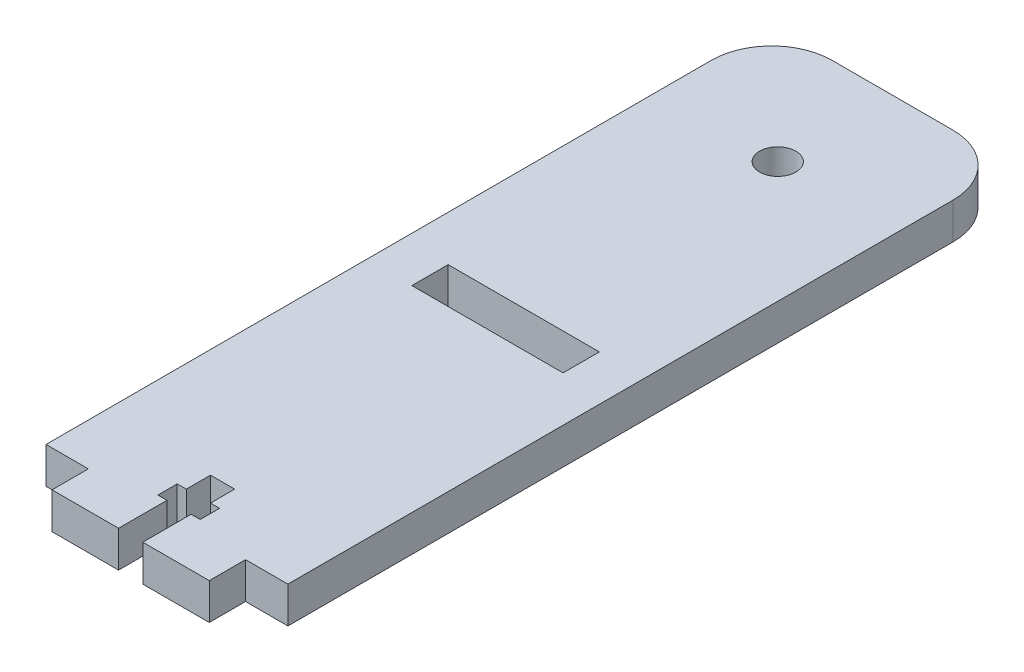
ISO-10303-21;
HEADER;
FILE_DESCRIPTION(('STEP AP214'),'2;1');
FILE_NAME('part.step','',(''),(''),'','','');
FILE_SCHEMA(('AUTOMOTIVE_DESIGN { 1 0 10303 214 1 1 1 1 }'));
ENDSEC;
DATA;
#1=APPLICATION_CONTEXT('core data for automotive mechanical design processes');
#2=APPLICATION_PROTOCOL_DEFINITION('international standard','automotive_design',2000,#1);
#3=PRODUCT_CONTEXT('',#1,'mechanical');
#4=PRODUCT('Part','Part','',(#3));
#5=PRODUCT_RELATED_PRODUCT_CATEGORY('part','',(#4));
#6=PRODUCT_DEFINITION_FORMATION('','',#4);
#7=PRODUCT_DEFINITION_CONTEXT('part definition',#1,'design');
#8=PRODUCT_DEFINITION('design','',#6,#7);
#9=PRODUCT_DEFINITION_SHAPE('','',#8);
#10=(LENGTH_UNIT() NAMED_UNIT(*) SI_UNIT(.MILLI.,.METRE.));
#11=(NAMED_UNIT(*) PLANE_ANGLE_UNIT() SI_UNIT($,.RADIAN.));
#12=(NAMED_UNIT(*) SI_UNIT($,.STERADIAN.) SOLID_ANGLE_UNIT());
#13=UNCERTAINTY_MEASURE_WITH_UNIT(LENGTH_MEASURE(1.E-05),#10,'distance_accuracy_value','');
#14=(GEOMETRIC_REPRESENTATION_CONTEXT(3) GLOBAL_UNCERTAINTY_ASSIGNED_CONTEXT((#13)) GLOBAL_UNIT_ASSIGNED_CONTEXT((#10,
#11,#12)) REPRESENTATION_CONTEXT('',''));
#15=CARTESIAN_POINT('',(0.,0.,0.));
#16=DIRECTION('',(0.,0.,1.));
#17=DIRECTION('',(1.,0.,0.));
#18=AXIS2_PLACEMENT_3D('',#15,#16,#17);
#19=CARTESIAN_POINT('',(9.99999999999999,6.,-52.7617663064734));
#20=DIRECTION('',(0.,-1.,0.));
#21=DIRECTION('',(0.,0.,-1.));
#22=AXIS2_PLACEMENT_3D('',#19,#20,#21);
#23=PLANE('',#22);
#24=CARTESIAN_POINT('',(0.,6.,-43.7617663064734));
#25=DIRECTION('',(0.,1.,0.));
#26=DIRECTION('',(0.,0.,1.));
#27=AXIS2_PLACEMENT_3D('',#24,#25,#26);
#28=CIRCLE('',#27,3.);
#29=CARTESIAN_POINT('',(0.,6.,-40.7617663064734));
#30=VERTEX_POINT('',#29);
#31=EDGE_CURVE('E246',#30,#30,#28,.T.);
#32=ORIENTED_EDGE('',*,*,#31,.F.);
#33=EDGE_LOOP('',(#32));
#34=FACE_BOUND('',#33,.T.);
#35=DIRECTION('',(1.,0.,0.));
#36=VECTOR('',#35,1.);
#37=CARTESIAN_POINT('',(13.,6.,57.2382336935266));
#38=LINE('',#37,#36);
#39=CARTESIAN_POINT('',(13.,6.,57.2382336935266));
#40=VERTEX_POINT('',#39);
#41=CARTESIAN_POINT('',(20.,6.,57.2382336935266));
#42=VERTEX_POINT('',#41);
#43=EDGE_CURVE('E252',#40,#42,#38,.T.);
#44=ORIENTED_EDGE('',*,*,#43,.T.);
#45=DIRECTION('',(0.,0.,-1.));
#46=VECTOR('',#45,1.);
#47=CARTESIAN_POINT('',(20.,6.,-52.7617663064734));
#48=LINE('',#47,#46);
#49=CARTESIAN_POINT('',(20.,6.,-52.7617663064734));
#50=VERTEX_POINT('',#49);
#51=EDGE_CURVE('E255',#42,#50,#48,.T.);
#52=ORIENTED_EDGE('',*,*,#51,.T.);
#53=CARTESIAN_POINT('',(9.99999999999999,6.,-52.7617663064734));
#54=DIRECTION('',(0.,1.,0.));
#55=DIRECTION('',(0.,0.,-1.));
#56=AXIS2_PLACEMENT_3D('',#53,#54,#55);
#57=CIRCLE('',#56,10.);
#58=CARTESIAN_POINT('',(9.99999999999999,6.,-62.7617663064734));
#59=VERTEX_POINT('',#58);
#60=EDGE_CURVE('E258',#50,#59,#57,.T.);
#61=ORIENTED_EDGE('',*,*,#60,.T.);
#62=DIRECTION('',(-1.,0.,0.));
#63=VECTOR('',#62,1.);
#64=CARTESIAN_POINT('',(-10.,6.,-62.7617663064734));
#65=LINE('',#64,#63);
#66=CARTESIAN_POINT('',(-10.,6.,-62.7617663064734));
#67=VERTEX_POINT('',#66);
#68=EDGE_CURVE('E260',#59,#67,#65,.T.);
#69=ORIENTED_EDGE('',*,*,#68,.T.);
#70=CARTESIAN_POINT('',(-10.,6.,-52.7617663064734));
#71=DIRECTION('',(0.,1.,0.));
#72=DIRECTION('',(0.,0.,1.));
#73=AXIS2_PLACEMENT_3D('',#70,#71,#72);
#74=CIRCLE('',#73,10.);
#75=CARTESIAN_POINT('',(-20.,6.,-52.7617663064734));
#76=VERTEX_POINT('',#75);
#77=EDGE_CURVE('E262',#67,#76,#74,.T.);
#78=ORIENTED_EDGE('',*,*,#77,.T.);
#79=DIRECTION('',(0.,0.,1.));
#80=VECTOR('',#79,1.);
#81=CARTESIAN_POINT('',(-20.,6.,-52.7617663064734));
#82=LINE('',#81,#80);
#83=CARTESIAN_POINT('',(-20.,6.,57.2382336935266));
#84=VERTEX_POINT('',#83);
#85=EDGE_CURVE('E264',#76,#84,#82,.T.);
#86=ORIENTED_EDGE('',*,*,#85,.T.);
#87=DIRECTION('',(1.,0.,0.));
#88=VECTOR('',#87,1.);
#89=CARTESIAN_POINT('',(-20.,6.,57.2382336935266));
#90=LINE('',#89,#88);
#91=CARTESIAN_POINT('',(-13.,6.,57.2382336935266));
#92=VERTEX_POINT('',#91);
#93=EDGE_CURVE('E266',#84,#92,#90,.T.);
#94=ORIENTED_EDGE('',*,*,#93,.T.);
#95=DIRECTION('',(0.,0.,1.));
#96=VECTOR('',#95,1.);
#97=CARTESIAN_POINT('',(-13.,6.,57.2382336935266));
#98=LINE('',#97,#96);
#99=CARTESIAN_POINT('',(-13.,6.,63.2382336935266));
#100=VERTEX_POINT('',#99);
#101=EDGE_CURVE('E268',#92,#100,#98,.T.);
#102=ORIENTED_EDGE('',*,*,#101,.T.);
#103=DIRECTION('',(1.,0.,0.));
#104=VECTOR('',#103,1.);
#105=CARTESIAN_POINT('',(-13.,6.,63.2382336935266));
#106=LINE('',#105,#104);
#107=CARTESIAN_POINT('',(-1.99999999999998,6.,63.2382336935266));
#108=VERTEX_POINT('',#107);
#109=EDGE_CURVE('E270',#100,#108,#106,.T.);
#110=ORIENTED_EDGE('',*,*,#109,.T.);
#111=DIRECTION('',(0.,0.,-1.));
#112=VECTOR('',#111,1.);
#113=CARTESIAN_POINT('',(-1.99999999999998,6.,63.2382336935266));
#114=LINE('',#113,#112);
#115=CARTESIAN_POINT('',(-1.99999999999998,6.,55.2382336935266));
#116=VERTEX_POINT('',#115);
#117=EDGE_CURVE('E272',#108,#116,#114,.T.);
#118=ORIENTED_EDGE('',*,*,#117,.T.);
#119=DIRECTION('',(-1.,0.,0.));
#120=VECTOR('',#119,1.);
#121=CARTESIAN_POINT('',(-1.99999999999998,6.,55.2382336935266));
#122=LINE('',#121,#120);
#123=CARTESIAN_POINT('',(-3.49999999999998,6.,55.2382336935266));
#124=VERTEX_POINT('',#123);
#125=EDGE_CURVE('E274',#116,#124,#122,.T.);
#126=ORIENTED_EDGE('',*,*,#125,.T.);
#127=DIRECTION('',(0.,0.,-1.));
#128=VECTOR('',#127,1.);
#129=CARTESIAN_POINT('',(-3.49999999999998,6.,55.2382336935266));
#130=LINE('',#129,#128);
#131=CARTESIAN_POINT('',(-3.49999999999998,6.,52.0382336935266));
#132=VERTEX_POINT('',#131);
#133=EDGE_CURVE('E276',#124,#132,#130,.T.);
#134=ORIENTED_EDGE('',*,*,#133,.T.);
#135=DIRECTION('',(1.,0.,0.));
#136=VECTOR('',#135,1.);
#137=CARTESIAN_POINT('',(-3.49999999999998,6.,52.0382336935266));
#138=LINE('',#137,#136);
#139=CARTESIAN_POINT('',(-1.99999999999998,6.,52.0382336935266));
#140=VERTEX_POINT('',#139);
#141=EDGE_CURVE('E278',#132,#140,#138,.T.);
#142=ORIENTED_EDGE('',*,*,#141,.T.);
#143=DIRECTION('',(0.,0.,-1.));
#144=VECTOR('',#143,1.);
#145=CARTESIAN_POINT('',(-1.99999999999998,6.,52.0382336935266));
#146=LINE('',#145,#144);
#147=CARTESIAN_POINT('',(-1.99999999999998,6.,48.0382336935266));
#148=VERTEX_POINT('',#147);
#149=EDGE_CURVE('E280',#140,#148,#146,.T.);
#150=ORIENTED_EDGE('',*,*,#149,.T.);
#151=DIRECTION('',(1.,0.,0.));
#152=VECTOR('',#151,1.);
#153=CARTESIAN_POINT('',(-1.99999999999998,6.,48.0382336935266));
#154=LINE('',#153,#152);
#155=CARTESIAN_POINT('',(2.00000000000002,6.,48.0382336935266));
#156=VERTEX_POINT('',#155);
#157=EDGE_CURVE('E282',#148,#156,#154,.T.);
#158=ORIENTED_EDGE('',*,*,#157,.T.);
#159=DIRECTION('',(0.,0.,1.));
#160=VECTOR('',#159,1.);
#161=CARTESIAN_POINT('',(2.00000000000002,6.,48.0382336935266));
#162=LINE('',#161,#160);
#163=CARTESIAN_POINT('',(2.00000000000002,6.,52.0382336935266));
#164=VERTEX_POINT('',#163);
#165=EDGE_CURVE('E284',#156,#164,#162,.T.);
#166=ORIENTED_EDGE('',*,*,#165,.T.);
#167=DIRECTION('',(1.,0.,0.));
#168=VECTOR('',#167,1.);
#169=CARTESIAN_POINT('',(2.00000000000002,6.,52.0382336935266));
#170=LINE('',#169,#168);
#171=CARTESIAN_POINT('',(3.50000000000002,6.,52.0382336935266));
#172=VERTEX_POINT('',#171);
#173=EDGE_CURVE('E286',#164,#172,#170,.T.);
#174=ORIENTED_EDGE('',*,*,#173,.T.);
#175=DIRECTION('',(0.,0.,1.));
#176=VECTOR('',#175,1.);
#177=CARTESIAN_POINT('',(3.50000000000002,6.,52.0382336935266));
#178=LINE('',#177,#176);
#179=CARTESIAN_POINT('',(3.50000000000002,6.,55.2382336935266));
#180=VERTEX_POINT('',#179);
#181=EDGE_CURVE('E288',#172,#180,#178,.T.);
#182=ORIENTED_EDGE('',*,*,#181,.T.);
#183=DIRECTION('',(-1.,0.,0.));
#184=VECTOR('',#183,1.);
#185=CARTESIAN_POINT('',(3.50000000000002,6.,55.2382336935266));
#186=LINE('',#185,#184);
#187=CARTESIAN_POINT('',(2.00000000000002,6.,55.2382336935266));
#188=VERTEX_POINT('',#187);
#189=EDGE_CURVE('E290',#180,#188,#186,.T.);
#190=ORIENTED_EDGE('',*,*,#189,.T.);
#191=DIRECTION('',(0.,0.,1.));
#192=VECTOR('',#191,1.);
#193=CARTESIAN_POINT('',(2.00000000000002,6.,55.2382336935266));
#194=LINE('',#193,#192);
#195=CARTESIAN_POINT('',(2.00000000000002,6.,63.2382336935266));
#196=VERTEX_POINT('',#195);
#197=EDGE_CURVE('E292',#188,#196,#194,.T.);
#198=ORIENTED_EDGE('',*,*,#197,.T.);
#199=DIRECTION('',(1.,0.,0.));
#200=VECTOR('',#199,1.);
#201=CARTESIAN_POINT('',(2.00000000000002,6.,63.2382336935266));
#202=LINE('',#201,#200);
#203=CARTESIAN_POINT('',(13.,6.,63.2382336935266));
#204=VERTEX_POINT('',#203);
#205=EDGE_CURVE('E294',#196,#204,#202,.T.);
#206=ORIENTED_EDGE('',*,*,#205,.T.);
#207=DIRECTION('',(0.,0.,-1.));
#208=VECTOR('',#207,1.);
#209=CARTESIAN_POINT('',(13.,6.,63.2382336935266));
#210=LINE('',#209,#208);
#211=EDGE_CURVE('E296',#204,#40,#210,.T.);
#212=ORIENTED_EDGE('',*,*,#211,.T.);
#213=EDGE_LOOP('',(#44,#52,#61,#69,#78,#86,#94,#102,#110,#118,#126,#134,#142,#150,#158,#166,
#174,#182,#190,#198,#206,#212));
#214=FACE_BOUND('',#213,.T.);
#215=DIRECTION('',(0.,0.,-1.));
#216=VECTOR('',#215,1.);
#217=CARTESIAN_POINT('',(12.5,6.,-1.7617663064734));
#218=LINE('',#217,#216);
#219=CARTESIAN_POINT('',(12.5,6.,4.23823369352659));
#220=VERTEX_POINT('',#219);
#221=CARTESIAN_POINT('',(12.5,6.,-1.7617663064734));
#222=VERTEX_POINT('',#221);
#223=EDGE_CURVE('E210',#220,#222,#218,.T.);
#224=ORIENTED_EDGE('',*,*,#223,.F.);
#225=DIRECTION('',(1.,0.,0.));
#226=VECTOR('',#225,1.);
#227=CARTESIAN_POINT('',(-12.5,6.,4.23823369352659));
#228=LINE('',#227,#226);
#229=CARTESIAN_POINT('',(-12.5,6.,4.23823369352659));
#230=VERTEX_POINT('',#229);
#231=EDGE_CURVE('E232',#230,#220,#228,.T.);
#232=ORIENTED_EDGE('',*,*,#231,.F.);
#233=DIRECTION('',(0.,0.,1.));
#234=VECTOR('',#233,1.);
#235=CARTESIAN_POINT('',(-12.5,6.,-1.7617663064734));
#236=LINE('',#235,#234);
#237=CARTESIAN_POINT('',(-12.5,6.,-1.7617663064734));
#238=VERTEX_POINT('',#237);
#239=EDGE_CURVE('E230',#238,#230,#236,.T.);
#240=ORIENTED_EDGE('',*,*,#239,.F.);
#241=DIRECTION('',(-1.,0.,0.));
#242=VECTOR('',#241,1.);
#243=CARTESIAN_POINT('',(-12.5,6.,-1.7617663064734));
#244=LINE('',#243,#242);
#245=EDGE_CURVE('E218',#222,#238,#244,.T.);
#246=ORIENTED_EDGE('',*,*,#245,.F.);
#247=EDGE_LOOP('',(#224,#232,#240,#246));
#248=FACE_BOUND('',#247,.T.);
#249=ADVANCED_FACE('F37',(#34,#214,#248),#23,.F.);
#250=CARTESIAN_POINT('',(9.99999999999999,0.,-52.7617663064734));
#251=DIRECTION('',(0.,-1.,0.));
#252=DIRECTION('',(0.,0.,-1.));
#253=AXIS2_PLACEMENT_3D('',#250,#251,#252);
#254=PLANE('',#253);
#255=DIRECTION('',(1.,0.,0.));
#256=VECTOR('',#255,1.);
#257=CARTESIAN_POINT('',(13.,0.,57.2382336935266));
#258=LINE('',#257,#256);
#259=CARTESIAN_POINT('',(13.,0.,57.2382336935266));
#260=VERTEX_POINT('',#259);
#261=CARTESIAN_POINT('',(20.,0.,57.2382336935266));
#262=VERTEX_POINT('',#261);
#263=EDGE_CURVE('E249',#260,#262,#258,.T.);
#264=ORIENTED_EDGE('',*,*,#263,.F.);
#265=DIRECTION('',(0.,0.,-1.));
#266=VECTOR('',#265,1.);
#267=CARTESIAN_POINT('',(13.,0.,63.2382336935266));
#268=LINE('',#267,#266);
#269=CARTESIAN_POINT('',(13.,0.,63.2382336935266));
#270=VERTEX_POINT('',#269);
#271=EDGE_CURVE('E256',#270,#260,#268,.T.);
#272=ORIENTED_EDGE('',*,*,#271,.F.);
#273=DIRECTION('',(1.,0.,0.));
#274=VECTOR('',#273,1.);
#275=CARTESIAN_POINT('',(2.00000000000002,0.,63.2382336935266));
#276=LINE('',#275,#274);
#277=CARTESIAN_POINT('',(2.00000000000002,0.,63.2382336935266));
#278=VERTEX_POINT('',#277);
#279=EDGE_CURVE('E339',#278,#270,#276,.T.);
#280=ORIENTED_EDGE('',*,*,#279,.F.);
#281=DIRECTION('',(0.,0.,1.));
#282=VECTOR('',#281,1.);
#283=CARTESIAN_POINT('',(2.00000000000002,0.,55.2382336935266));
#284=LINE('',#283,#282);
#285=CARTESIAN_POINT('',(2.00000000000002,0.,55.2382336935266));
#286=VERTEX_POINT('',#285);
#287=EDGE_CURVE('E337',#286,#278,#284,.T.);
#288=ORIENTED_EDGE('',*,*,#287,.F.);
#289=DIRECTION('',(-1.,0.,0.));
#290=VECTOR('',#289,1.);
#291=CARTESIAN_POINT('',(3.50000000000002,0.,55.2382336935266));
#292=LINE('',#291,#290);
#293=CARTESIAN_POINT('',(3.50000000000002,0.,55.2382336935266));
#294=VERTEX_POINT('',#293);
#295=EDGE_CURVE('E335',#294,#286,#292,.T.);
#296=ORIENTED_EDGE('',*,*,#295,.F.);
#297=DIRECTION('',(0.,0.,1.));
#298=VECTOR('',#297,1.);
#299=CARTESIAN_POINT('',(3.50000000000002,0.,52.0382336935266));
#300=LINE('',#299,#298);
#301=CARTESIAN_POINT('',(3.50000000000002,0.,52.0382336935266));
#302=VERTEX_POINT('',#301);
#303=EDGE_CURVE('E333',#302,#294,#300,.T.);
#304=ORIENTED_EDGE('',*,*,#303,.F.);
#305=DIRECTION('',(1.,0.,0.));
#306=VECTOR('',#305,1.);
#307=CARTESIAN_POINT('',(2.00000000000002,0.,52.0382336935266));
#308=LINE('',#307,#306);
#309=CARTESIAN_POINT('',(2.00000000000002,0.,52.0382336935266));
#310=VERTEX_POINT('',#309);
#311=EDGE_CURVE('E331',#310,#302,#308,.T.);
#312=ORIENTED_EDGE('',*,*,#311,.F.);
#313=DIRECTION('',(0.,0.,1.));
#314=VECTOR('',#313,1.);
#315=CARTESIAN_POINT('',(2.00000000000002,0.,48.0382336935266));
#316=LINE('',#315,#314);
#317=CARTESIAN_POINT('',(2.00000000000002,0.,48.0382336935266));
#318=VERTEX_POINT('',#317);
#319=EDGE_CURVE('E329',#318,#310,#316,.T.);
#320=ORIENTED_EDGE('',*,*,#319,.F.);
#321=DIRECTION('',(1.,0.,0.));
#322=VECTOR('',#321,1.);
#323=CARTESIAN_POINT('',(-1.99999999999998,0.,48.0382336935266));
#324=LINE('',#323,#322);
#325=CARTESIAN_POINT('',(-1.99999999999998,0.,48.0382336935266));
#326=VERTEX_POINT('',#325);
#327=EDGE_CURVE('E327',#326,#318,#324,.T.);
#328=ORIENTED_EDGE('',*,*,#327,.F.);
#329=DIRECTION('',(0.,0.,-1.));
#330=VECTOR('',#329,1.);
#331=CARTESIAN_POINT('',(-1.99999999999998,0.,52.0382336935266));
#332=LINE('',#331,#330);
#333=CARTESIAN_POINT('',(-1.99999999999998,0.,52.0382336935266));
#334=VERTEX_POINT('',#333);
#335=EDGE_CURVE('E325',#334,#326,#332,.T.);
#336=ORIENTED_EDGE('',*,*,#335,.F.);
#337=DIRECTION('',(1.,0.,0.));
#338=VECTOR('',#337,1.);
#339=CARTESIAN_POINT('',(-3.49999999999998,0.,52.0382336935266));
#340=LINE('',#339,#338);
#341=CARTESIAN_POINT('',(-3.49999999999998,0.,52.0382336935266));
#342=VERTEX_POINT('',#341);
#343=EDGE_CURVE('E323',#342,#334,#340,.T.);
#344=ORIENTED_EDGE('',*,*,#343,.F.);
#345=DIRECTION('',(0.,0.,-1.));
#346=VECTOR('',#345,1.);
#347=CARTESIAN_POINT('',(-3.49999999999998,0.,55.2382336935266));
#348=LINE('',#347,#346);
#349=CARTESIAN_POINT('',(-3.49999999999998,0.,55.2382336935266));
#350=VERTEX_POINT('',#349);
#351=EDGE_CURVE('E321',#350,#342,#348,.T.);
#352=ORIENTED_EDGE('',*,*,#351,.F.);
#353=DIRECTION('',(-1.,0.,0.));
#354=VECTOR('',#353,1.);
#355=CARTESIAN_POINT('',(-1.99999999999998,0.,55.2382336935266));
#356=LINE('',#355,#354);
#357=CARTESIAN_POINT('',(-1.99999999999998,0.,55.2382336935266));
#358=VERTEX_POINT('',#357);
#359=EDGE_CURVE('E319',#358,#350,#356,.T.);
#360=ORIENTED_EDGE('',*,*,#359,.F.);
#361=DIRECTION('',(0.,0.,-1.));
#362=VECTOR('',#361,1.);
#363=CARTESIAN_POINT('',(-1.99999999999998,0.,63.2382336935266));
#364=LINE('',#363,#362);
#365=CARTESIAN_POINT('',(-1.99999999999998,0.,63.2382336935266));
#366=VERTEX_POINT('',#365);
#367=EDGE_CURVE('E317',#366,#358,#364,.T.);
#368=ORIENTED_EDGE('',*,*,#367,.F.);
#369=DIRECTION('',(1.,0.,0.));
#370=VECTOR('',#369,1.);
#371=CARTESIAN_POINT('',(-13.,0.,63.2382336935266));
#372=LINE('',#371,#370);
#373=CARTESIAN_POINT('',(-13.,0.,63.2382336935266));
#374=VERTEX_POINT('',#373);
#375=EDGE_CURVE('E315',#374,#366,#372,.T.);
#376=ORIENTED_EDGE('',*,*,#375,.F.);
#377=DIRECTION('',(0.,0.,1.));
#378=VECTOR('',#377,1.);
#379=CARTESIAN_POINT('',(-13.,0.,57.2382336935266));
#380=LINE('',#379,#378);
#381=CARTESIAN_POINT('',(-13.,0.,57.2382336935266));
#382=VERTEX_POINT('',#381);
#383=EDGE_CURVE('E313',#382,#374,#380,.T.);
#384=ORIENTED_EDGE('',*,*,#383,.F.);
#385=DIRECTION('',(1.,0.,0.));
#386=VECTOR('',#385,1.);
#387=CARTESIAN_POINT('',(-20.,0.,57.2382336935266));
#388=LINE('',#387,#386);
#389=CARTESIAN_POINT('',(-20.,0.,57.2382336935266));
#390=VERTEX_POINT('',#389);
#391=EDGE_CURVE('E311',#390,#382,#388,.T.);
#392=ORIENTED_EDGE('',*,*,#391,.F.);
#393=DIRECTION('',(0.,0.,1.));
#394=VECTOR('',#393,1.);
#395=CARTESIAN_POINT('',(-20.,0.,-52.7617663064734));
#396=LINE('',#395,#394);
#397=CARTESIAN_POINT('',(-20.,0.,-52.7617663064734));
#398=VERTEX_POINT('',#397);
#399=EDGE_CURVE('E309',#398,#390,#396,.T.);
#400=ORIENTED_EDGE('',*,*,#399,.F.);
#401=CARTESIAN_POINT('',(-10.,0.,-52.7617663064734));
#402=DIRECTION('',(0.,1.,0.));
#403=DIRECTION('',(0.,0.,1.));
#404=AXIS2_PLACEMENT_3D('',#401,#402,#403);
#405=CIRCLE('',#404,10.);
#406=CARTESIAN_POINT('',(-10.,0.,-62.7617663064734));
#407=VERTEX_POINT('',#406);
#408=EDGE_CURVE('E307',#407,#398,#405,.T.);
#409=ORIENTED_EDGE('',*,*,#408,.F.);
#410=DIRECTION('',(-1.,0.,0.));
#411=VECTOR('',#410,1.);
#412=CARTESIAN_POINT('',(-10.,0.,-62.7617663064734));
#413=LINE('',#412,#411);
#414=CARTESIAN_POINT('',(9.99999999999999,0.,-62.7617663064734));
#415=VERTEX_POINT('',#414);
#416=EDGE_CURVE('E305',#415,#407,#413,.T.);
#417=ORIENTED_EDGE('',*,*,#416,.F.);
#418=CARTESIAN_POINT('',(9.99999999999999,0.,-52.7617663064734));
#419=DIRECTION('',(0.,1.,0.));
#420=DIRECTION('',(0.,0.,-1.));
#421=AXIS2_PLACEMENT_3D('',#418,#419,#420);
#422=CIRCLE('',#421,10.);
#423=CARTESIAN_POINT('',(20.,0.,-52.7617663064734));
#424=VERTEX_POINT('',#423);
#425=EDGE_CURVE('E303',#424,#415,#422,.T.);
#426=ORIENTED_EDGE('',*,*,#425,.F.);
#427=DIRECTION('',(0.,0.,-1.));
#428=VECTOR('',#427,1.);
#429=CARTESIAN_POINT('',(20.,0.,-52.7617663064734));
#430=LINE('',#429,#428);
#431=EDGE_CURVE('E301',#262,#424,#430,.T.);
#432=ORIENTED_EDGE('',*,*,#431,.F.);
#433=EDGE_LOOP('',(#264,#272,#280,#288,#296,#304,#312,#320,#328,#336,#344,#352,#360,#368,#376,
#384,#392,#400,#409,#417,#426,#432));
#434=FACE_BOUND('',#433,.T.);
#435=CARTESIAN_POINT('',(0.,0.,-43.7617663064734));
#436=DIRECTION('',(0.,1.,0.));
#437=DIRECTION('',(0.,0.,1.));
#438=AXIS2_PLACEMENT_3D('',#435,#436,#437);
#439=CIRCLE('',#438,3.);
#440=CARTESIAN_POINT('',(0.,0.,-40.7617663064734));
#441=VERTEX_POINT('',#440);
#442=EDGE_CURVE('E226',#441,#441,#439,.T.);
#443=ORIENTED_EDGE('',*,*,#442,.T.);
#444=EDGE_LOOP('',(#443));
#445=FACE_BOUND('',#444,.T.);
#446=DIRECTION('',(1.,0.,0.));
#447=VECTOR('',#446,1.);
#448=CARTESIAN_POINT('',(-12.5,0.,4.23823369352659));
#449=LINE('',#448,#447);
#450=CARTESIAN_POINT('',(-12.5,0.,4.23823369352659));
#451=VERTEX_POINT('',#450);
#452=CARTESIAN_POINT('',(12.5,0.,4.23823369352659));
#453=VERTEX_POINT('',#452);
#454=EDGE_CURVE('E219',#451,#453,#449,.T.);
#455=ORIENTED_EDGE('',*,*,#454,.T.);
#456=DIRECTION('',(0.,0.,-1.));
#457=VECTOR('',#456,1.);
#458=CARTESIAN_POINT('',(12.5,0.,-1.7617663064734));
#459=LINE('',#458,#457);
#460=CARTESIAN_POINT('',(12.5,0.,-1.7617663064734));
#461=VERTEX_POINT('',#460);
#462=EDGE_CURVE('E60',#453,#461,#459,.T.);
#463=ORIENTED_EDGE('',*,*,#462,.T.);
#464=DIRECTION('',(-1.,0.,0.));
#465=VECTOR('',#464,1.);
#466=CARTESIAN_POINT('',(-12.5,0.,-1.7617663064734));
#467=LINE('',#466,#465);
#468=CARTESIAN_POINT('',(-12.5,0.,-1.7617663064734));
#469=VERTEX_POINT('',#468);
#470=EDGE_CURVE('E225',#461,#469,#467,.T.);
#471=ORIENTED_EDGE('',*,*,#470,.T.);
#472=DIRECTION('',(0.,0.,1.));
#473=VECTOR('',#472,1.);
#474=CARTESIAN_POINT('',(-12.5,0.,-1.7617663064734));
#475=LINE('',#474,#473);
#476=EDGE_CURVE('E238',#469,#451,#475,.T.);
#477=ORIENTED_EDGE('',*,*,#476,.T.);
#478=EDGE_LOOP('',(#455,#463,#471,#477));
#479=FACE_BOUND('',#478,.T.);
#480=ADVANCED_FACE('F411',(#434,#445,#479),#254,.T.);
#481=CARTESIAN_POINT('',(13.,6.,57.2382336935266));
#482=DIRECTION('',(0.,0.,-1.));
#483=DIRECTION('',(-1.,0.,0.));
#484=AXIS2_PLACEMENT_3D('',#481,#482,#483);
#485=PLANE('',#484);
#486=ORIENTED_EDGE('',*,*,#263,.T.);
#487=DIRECTION('',(0.,-1.,0.));
#488=VECTOR('',#487,1.);
#489=CARTESIAN_POINT('',(20.,6.,57.2382336935266));
#490=LINE('',#489,#488);
#491=EDGE_CURVE('E11',#42,#262,#490,.T.);
#492=ORIENTED_EDGE('',*,*,#491,.F.);
#493=ORIENTED_EDGE('',*,*,#43,.F.);
#494=DIRECTION('',(0.,-1.,0.));
#495=VECTOR('',#494,1.);
#496=CARTESIAN_POINT('',(13.,6.,57.2382336935266));
#497=LINE('',#496,#495);
#498=EDGE_CURVE('E298',#40,#260,#497,.T.);
#499=ORIENTED_EDGE('',*,*,#498,.T.);
#500=EDGE_LOOP('',(#486,#492,#493,#499));
#501=FACE_BOUND('',#500,.T.);
#502=ADVANCED_FACE('F39',(#501),#485,.F.);
#503=CARTESIAN_POINT('',(20.,6.,-52.7617663064734));
#504=DIRECTION('',(-1.,0.,0.));
#505=DIRECTION('',(0.,0.,1.));
#506=AXIS2_PLACEMENT_3D('',#503,#504,#505);
#507=PLANE('',#506);
#508=ORIENTED_EDGE('',*,*,#431,.T.);
#509=DIRECTION('',(0.,-1.,0.));
#510=VECTOR('',#509,1.);
#511=CARTESIAN_POINT('',(20.,6.,-52.7617663064734));
#512=LINE('',#511,#510);
#513=EDGE_CURVE('E45',#50,#424,#512,.T.);
#514=ORIENTED_EDGE('',*,*,#513,.F.);
#515=ORIENTED_EDGE('',*,*,#51,.F.);
#516=ORIENTED_EDGE('',*,*,#491,.T.);
#517=EDGE_LOOP('',(#508,#514,#515,#516));
#518=FACE_BOUND('',#517,.T.);
#519=ADVANCED_FACE('F428',(#518),#507,.F.);
#520=CARTESIAN_POINT('',(9.99999999999999,6.,-52.7617663064734));
#521=DIRECTION('',(0.,-1.,0.));
#522=DIRECTION('',(0.,0.,-1.));
#523=AXIS2_PLACEMENT_3D('',#520,#521,#522);
#524=CYLINDRICAL_SURFACE('',#523,10.);
#525=ORIENTED_EDGE('',*,*,#425,.T.);
#526=DIRECTION('',(0.,-1.,0.));
#527=VECTOR('',#526,1.);
#528=CARTESIAN_POINT('',(9.99999999999999,6.,-62.7617663064734));
#529=LINE('',#528,#527);
#530=EDGE_CURVE('E398',#59,#415,#529,.T.);
#531=ORIENTED_EDGE('',*,*,#530,.F.);
#532=ORIENTED_EDGE('',*,*,#60,.F.);
#533=ORIENTED_EDGE('',*,*,#513,.T.);
#534=EDGE_LOOP('',(#525,#531,#532,#533));
#535=FACE_BOUND('',#534,.T.);
#536=ADVANCED_FACE('F405',(#535),#524,.T.);
#537=CARTESIAN_POINT('',(-10.,6.,-62.7617663064734));
#538=DIRECTION('',(0.,0.,1.));
#539=DIRECTION('',(1.,0.,0.));
#540=AXIS2_PLACEMENT_3D('',#537,#538,#539);
#541=PLANE('',#540);
#542=ORIENTED_EDGE('',*,*,#416,.T.);
#543=DIRECTION('',(0.,-1.,0.));
#544=VECTOR('',#543,1.);
#545=CARTESIAN_POINT('',(-10.,6.,-62.7617663064734));
#546=LINE('',#545,#544);
#547=EDGE_CURVE('E395',#67,#407,#546,.T.);
#548=ORIENTED_EDGE('',*,*,#547,.F.);
#549=ORIENTED_EDGE('',*,*,#68,.F.);
#550=ORIENTED_EDGE('',*,*,#530,.T.);
#551=EDGE_LOOP('',(#542,#548,#549,#550));
#552=FACE_BOUND('',#551,.T.);
#553=ADVANCED_FACE('F417',(#552),#541,.F.);
#554=CARTESIAN_POINT('',(-10.,6.,-52.7617663064734));
#555=DIRECTION('',(0.,-1.,0.));
#556=DIRECTION('',(0.,0.,-1.));
#557=AXIS2_PLACEMENT_3D('',#554,#555,#556);
#558=CYLINDRICAL_SURFACE('',#557,10.);
#559=ORIENTED_EDGE('',*,*,#408,.T.);
#560=DIRECTION('',(0.,-1.,0.));
#561=VECTOR('',#560,1.);
#562=CARTESIAN_POINT('',(-20.,6.,-52.7617663064734));
#563=LINE('',#562,#561);
#564=EDGE_CURVE('E392',#76,#398,#563,.T.);
#565=ORIENTED_EDGE('',*,*,#564,.F.);
#566=ORIENTED_EDGE('',*,*,#77,.F.);
#567=ORIENTED_EDGE('',*,*,#547,.T.);
#568=EDGE_LOOP('',(#559,#565,#566,#567));
#569=FACE_BOUND('',#568,.T.);
#570=ADVANCED_FACE('F421',(#569),#558,.T.);
#571=CARTESIAN_POINT('',(-20.,6.,-52.7617663064734));
#572=DIRECTION('',(1.,0.,0.));
#573=DIRECTION('',(0.,0.,-1.));
#574=AXIS2_PLACEMENT_3D('',#571,#572,#573);
#575=PLANE('',#574);
#576=ORIENTED_EDGE('',*,*,#399,.T.);
#577=DIRECTION('',(0.,-1.,0.));
#578=VECTOR('',#577,1.);
#579=CARTESIAN_POINT('',(-20.,6.,57.2382336935266));
#580=LINE('',#579,#578);
#581=EDGE_CURVE('E389',#84,#390,#580,.T.);
#582=ORIENTED_EDGE('',*,*,#581,.F.);
#583=ORIENTED_EDGE('',*,*,#85,.F.);
#584=ORIENTED_EDGE('',*,*,#564,.T.);
#585=EDGE_LOOP('',(#576,#582,#583,#584));
#586=FACE_BOUND('',#585,.T.);
#587=ADVANCED_FACE('F511',(#586),#575,.F.);
#588=CARTESIAN_POINT('',(-20.,6.,57.2382336935266));
#589=DIRECTION('',(0.,0.,-1.));
#590=DIRECTION('',(-1.,0.,0.));
#591=AXIS2_PLACEMENT_3D('',#588,#589,#590);
#592=PLANE('',#591);
#593=ORIENTED_EDGE('',*,*,#391,.T.);
#594=DIRECTION('',(0.,-1.,0.));
#595=VECTOR('',#594,1.);
#596=CARTESIAN_POINT('',(-13.,6.,57.2382336935266));
#597=LINE('',#596,#595);
#598=EDGE_CURVE('E386',#92,#382,#597,.T.);
#599=ORIENTED_EDGE('',*,*,#598,.F.);
#600=ORIENTED_EDGE('',*,*,#93,.F.);
#601=ORIENTED_EDGE('',*,*,#581,.T.);
#602=EDGE_LOOP('',(#593,#599,#600,#601));
#603=FACE_BOUND('',#602,.T.);
#604=ADVANCED_FACE('F508',(#603),#592,.F.);
#605=CARTESIAN_POINT('',(-13.,6.,57.2382336935266));
#606=DIRECTION('',(1.,0.,0.));
#607=DIRECTION('',(0.,0.,-1.));
#608=AXIS2_PLACEMENT_3D('',#605,#606,#607);
#609=PLANE('',#608);
#610=ORIENTED_EDGE('',*,*,#383,.T.);
#611=DIRECTION('',(0.,-1.,0.));
#612=VECTOR('',#611,1.);
#613=CARTESIAN_POINT('',(-13.,6.,63.2382336935266));
#614=LINE('',#613,#612);
#615=EDGE_CURVE('E383',#100,#374,#614,.T.);
#616=ORIENTED_EDGE('',*,*,#615,.F.);
#617=ORIENTED_EDGE('',*,*,#101,.F.);
#618=ORIENTED_EDGE('',*,*,#598,.T.);
#619=EDGE_LOOP('',(#610,#616,#617,#618));
#620=FACE_BOUND('',#619,.T.);
#621=ADVANCED_FACE('F504',(#620),#609,.F.);
#622=CARTESIAN_POINT('',(-13.,6.,63.2382336935266));
#623=DIRECTION('',(0.,0.,-1.));
#624=DIRECTION('',(-1.,0.,0.));
#625=AXIS2_PLACEMENT_3D('',#622,#623,#624);
#626=PLANE('',#625);
#627=ORIENTED_EDGE('',*,*,#375,.T.);
#628=DIRECTION('',(0.,-1.,0.));
#629=VECTOR('',#628,1.);
#630=CARTESIAN_POINT('',(-1.99999999999998,6.,63.2382336935266));
#631=LINE('',#630,#629);
#632=EDGE_CURVE('E380',#108,#366,#631,.T.);
#633=ORIENTED_EDGE('',*,*,#632,.F.);
#634=ORIENTED_EDGE('',*,*,#109,.F.);
#635=ORIENTED_EDGE('',*,*,#615,.T.);
#636=EDGE_LOOP('',(#627,#633,#634,#635));
#637=FACE_BOUND('',#636,.T.);
#638=ADVANCED_FACE('F500',(#637),#626,.F.);
#639=CARTESIAN_POINT('',(-1.99999999999998,6.,63.2382336935266));
#640=DIRECTION('',(-1.,0.,0.));
#641=DIRECTION('',(0.,0.,1.));
#642=AXIS2_PLACEMENT_3D('',#639,#640,#641);
#643=PLANE('',#642);
#644=ORIENTED_EDGE('',*,*,#367,.T.);
#645=DIRECTION('',(0.,-1.,0.));
#646=VECTOR('',#645,1.);
#647=CARTESIAN_POINT('',(-1.99999999999998,6.,55.2382336935266));
#648=LINE('',#647,#646);
#649=EDGE_CURVE('E377',#116,#358,#648,.T.);
#650=ORIENTED_EDGE('',*,*,#649,.F.);
#651=ORIENTED_EDGE('',*,*,#117,.F.);
#652=ORIENTED_EDGE('',*,*,#632,.T.);
#653=EDGE_LOOP('',(#644,#650,#651,#652));
#654=FACE_BOUND('',#653,.T.);
#655=ADVANCED_FACE('F495',(#654),#643,.F.);
#656=CARTESIAN_POINT('',(-1.99999999999998,6.,55.2382336935266));
#657=DIRECTION('',(0.,0.,1.));
#658=DIRECTION('',(1.,0.,0.));
#659=AXIS2_PLACEMENT_3D('',#656,#657,#658);
#660=PLANE('',#659);
#661=ORIENTED_EDGE('',*,*,#359,.T.);
#662=DIRECTION('',(0.,-1.,0.));
#663=VECTOR('',#662,1.);
#664=CARTESIAN_POINT('',(-3.49999999999998,6.,55.2382336935266));
#665=LINE('',#664,#663);
#666=EDGE_CURVE('E374',#124,#350,#665,.T.);
#667=ORIENTED_EDGE('',*,*,#666,.F.);
#668=ORIENTED_EDGE('',*,*,#125,.F.);
#669=ORIENTED_EDGE('',*,*,#649,.T.);
#670=EDGE_LOOP('',(#661,#667,#668,#669));
#671=FACE_BOUND('',#670,.T.);
#672=ADVANCED_FACE('F489',(#671),#660,.F.);
#673=CARTESIAN_POINT('',(-3.49999999999998,6.,55.2382336935266));
#674=DIRECTION('',(-1.,0.,0.));
#675=DIRECTION('',(0.,0.,1.));
#676=AXIS2_PLACEMENT_3D('',#673,#674,#675);
#677=PLANE('',#676);
#678=ORIENTED_EDGE('',*,*,#351,.T.);
#679=DIRECTION('',(0.,-1.,0.));
#680=VECTOR('',#679,1.);
#681=CARTESIAN_POINT('',(-3.49999999999998,6.,52.0382336935266));
#682=LINE('',#681,#680);
#683=EDGE_CURVE('E371',#132,#342,#682,.T.);
#684=ORIENTED_EDGE('',*,*,#683,.F.);
#685=ORIENTED_EDGE('',*,*,#133,.F.);
#686=ORIENTED_EDGE('',*,*,#666,.T.);
#687=EDGE_LOOP('',(#678,#684,#685,#686));
#688=FACE_BOUND('',#687,.T.);
#689=ADVANCED_FACE('F485',(#688),#677,.F.);
#690=CARTESIAN_POINT('',(-3.49999999999998,6.,52.0382336935266));
#691=DIRECTION('',(0.,0.,-1.));
#692=DIRECTION('',(-1.,0.,0.));
#693=AXIS2_PLACEMENT_3D('',#690,#691,#692);
#694=PLANE('',#693);
#695=ORIENTED_EDGE('',*,*,#343,.T.);
#696=DIRECTION('',(0.,-1.,0.));
#697=VECTOR('',#696,1.);
#698=CARTESIAN_POINT('',(-1.99999999999998,6.,52.0382336935266));
#699=LINE('',#698,#697);
#700=EDGE_CURVE('E368',#140,#334,#699,.T.);
#701=ORIENTED_EDGE('',*,*,#700,.F.);
#702=ORIENTED_EDGE('',*,*,#141,.F.);
#703=ORIENTED_EDGE('',*,*,#683,.T.);
#704=EDGE_LOOP('',(#695,#701,#702,#703));
#705=FACE_BOUND('',#704,.T.);
#706=ADVANCED_FACE('F480',(#705),#694,.F.);
#707=CARTESIAN_POINT('',(-1.99999999999998,6.,52.0382336935266));
#708=DIRECTION('',(-1.,0.,0.));
#709=DIRECTION('',(0.,0.,1.));
#710=AXIS2_PLACEMENT_3D('',#707,#708,#709);
#711=PLANE('',#710);
#712=ORIENTED_EDGE('',*,*,#335,.T.);
#713=DIRECTION('',(0.,-1.,0.));
#714=VECTOR('',#713,1.);
#715=CARTESIAN_POINT('',(-1.99999999999998,6.,48.0382336935266));
#716=LINE('',#715,#714);
#717=EDGE_CURVE('E365',#148,#326,#716,.T.);
#718=ORIENTED_EDGE('',*,*,#717,.F.);
#719=ORIENTED_EDGE('',*,*,#149,.F.);
#720=ORIENTED_EDGE('',*,*,#700,.T.);
#721=EDGE_LOOP('',(#712,#718,#719,#720));
#722=FACE_BOUND('',#721,.T.);
#723=ADVANCED_FACE('F474',(#722),#711,.F.);
#724=CARTESIAN_POINT('',(-1.99999999999998,6.,48.0382336935266));
#725=DIRECTION('',(0.,0.,-1.));
#726=DIRECTION('',(-1.,0.,0.));
#727=AXIS2_PLACEMENT_3D('',#724,#725,#726);
#728=PLANE('',#727);
#729=ORIENTED_EDGE('',*,*,#327,.T.);
#730=DIRECTION('',(0.,-1.,0.));
#731=VECTOR('',#730,1.);
#732=CARTESIAN_POINT('',(2.00000000000002,6.,48.0382336935266));
#733=LINE('',#732,#731);
#734=EDGE_CURVE('E362',#156,#318,#733,.T.);
#735=ORIENTED_EDGE('',*,*,#734,.F.);
#736=ORIENTED_EDGE('',*,*,#157,.F.);
#737=ORIENTED_EDGE('',*,*,#717,.T.);
#738=EDGE_LOOP('',(#729,#735,#736,#737));
#739=FACE_BOUND('',#738,.T.);
#740=ADVANCED_FACE('F470',(#739),#728,.F.);
#741=CARTESIAN_POINT('',(2.00000000000002,6.,48.0382336935266));
#742=DIRECTION('',(1.,0.,0.));
#743=DIRECTION('',(0.,0.,-1.));
#744=AXIS2_PLACEMENT_3D('',#741,#742,#743);
#745=PLANE('',#744);
#746=ORIENTED_EDGE('',*,*,#319,.T.);
#747=DIRECTION('',(0.,-1.,0.));
#748=VECTOR('',#747,1.);
#749=CARTESIAN_POINT('',(2.00000000000002,6.,52.0382336935266));
#750=LINE('',#749,#748);
#751=EDGE_CURVE('E359',#164,#310,#750,.T.);
#752=ORIENTED_EDGE('',*,*,#751,.F.);
#753=ORIENTED_EDGE('',*,*,#165,.F.);
#754=ORIENTED_EDGE('',*,*,#734,.T.);
#755=EDGE_LOOP('',(#746,#752,#753,#754));
#756=FACE_BOUND('',#755,.T.);
#757=ADVANCED_FACE('F465',(#756),#745,.F.);
#758=CARTESIAN_POINT('',(2.00000000000002,6.,52.0382336935266));
#759=DIRECTION('',(0.,0.,-1.));
#760=DIRECTION('',(-1.,0.,0.));
#761=AXIS2_PLACEMENT_3D('',#758,#759,#760);
#762=PLANE('',#761);
#763=ORIENTED_EDGE('',*,*,#311,.T.);
#764=DIRECTION('',(0.,-1.,0.));
#765=VECTOR('',#764,1.);
#766=CARTESIAN_POINT('',(3.50000000000002,6.,52.0382336935266));
#767=LINE('',#766,#765);
#768=EDGE_CURVE('E356',#172,#302,#767,.T.);
#769=ORIENTED_EDGE('',*,*,#768,.F.);
#770=ORIENTED_EDGE('',*,*,#173,.F.);
#771=ORIENTED_EDGE('',*,*,#751,.T.);
#772=EDGE_LOOP('',(#763,#769,#770,#771));
#773=FACE_BOUND('',#772,.T.);
#774=ADVANCED_FACE('F459',(#773),#762,.F.);
#775=CARTESIAN_POINT('',(3.50000000000002,6.,52.0382336935266));
#776=DIRECTION('',(1.,0.,0.));
#777=DIRECTION('',(0.,0.,-1.));
#778=AXIS2_PLACEMENT_3D('',#775,#776,#777);
#779=PLANE('',#778);
#780=ORIENTED_EDGE('',*,*,#303,.T.);
#781=DIRECTION('',(0.,-1.,0.));
#782=VECTOR('',#781,1.);
#783=CARTESIAN_POINT('',(3.50000000000002,6.,55.2382336935266));
#784=LINE('',#783,#782);
#785=EDGE_CURVE('E353',#180,#294,#784,.T.);
#786=ORIENTED_EDGE('',*,*,#785,.F.);
#787=ORIENTED_EDGE('',*,*,#181,.F.);
#788=ORIENTED_EDGE('',*,*,#768,.T.);
#789=EDGE_LOOP('',(#780,#786,#787,#788));
#790=FACE_BOUND('',#789,.T.);
#791=ADVANCED_FACE('F455',(#790),#779,.F.);
#792=CARTESIAN_POINT('',(3.50000000000002,6.,55.2382336935266));
#793=DIRECTION('',(0.,0.,1.));
#794=DIRECTION('',(1.,0.,0.));
#795=AXIS2_PLACEMENT_3D('',#792,#793,#794);
#796=PLANE('',#795);
#797=ORIENTED_EDGE('',*,*,#295,.T.);
#798=DIRECTION('',(0.,-1.,0.));
#799=VECTOR('',#798,1.);
#800=CARTESIAN_POINT('',(2.00000000000002,6.,55.2382336935266));
#801=LINE('',#800,#799);
#802=EDGE_CURVE('E350',#188,#286,#801,.T.);
#803=ORIENTED_EDGE('',*,*,#802,.F.);
#804=ORIENTED_EDGE('',*,*,#189,.F.);
#805=ORIENTED_EDGE('',*,*,#785,.T.);
#806=EDGE_LOOP('',(#797,#803,#804,#805));
#807=FACE_BOUND('',#806,.T.);
#808=ADVANCED_FACE('F450',(#807),#796,.F.);
#809=CARTESIAN_POINT('',(2.00000000000002,6.,55.2382336935266));
#810=DIRECTION('',(1.,0.,0.));
#811=DIRECTION('',(0.,0.,-1.));
#812=AXIS2_PLACEMENT_3D('',#809,#810,#811);
#813=PLANE('',#812);
#814=ORIENTED_EDGE('',*,*,#287,.T.);
#815=DIRECTION('',(0.,-1.,0.));
#816=VECTOR('',#815,1.);
#817=CARTESIAN_POINT('',(2.00000000000002,6.,63.2382336935266));
#818=LINE('',#817,#816);
#819=EDGE_CURVE('E347',#196,#278,#818,.T.);
#820=ORIENTED_EDGE('',*,*,#819,.F.);
#821=ORIENTED_EDGE('',*,*,#197,.F.);
#822=ORIENTED_EDGE('',*,*,#802,.T.);
#823=EDGE_LOOP('',(#814,#820,#821,#822));
#824=FACE_BOUND('',#823,.T.);
#825=ADVANCED_FACE('F444',(#824),#813,.F.);
#826=CARTESIAN_POINT('',(2.00000000000002,6.,63.2382336935266));
#827=DIRECTION('',(0.,0.,-1.));
#828=DIRECTION('',(-1.,0.,0.));
#829=AXIS2_PLACEMENT_3D('',#826,#827,#828);
#830=PLANE('',#829);
#831=ORIENTED_EDGE('',*,*,#279,.T.);
#832=DIRECTION('',(0.,-1.,0.));
#833=VECTOR('',#832,1.);
#834=CARTESIAN_POINT('',(13.,6.,63.2382336935266));
#835=LINE('',#834,#833);
#836=EDGE_CURVE('E344',#204,#270,#835,.T.);
#837=ORIENTED_EDGE('',*,*,#836,.F.);
#838=ORIENTED_EDGE('',*,*,#205,.F.);
#839=ORIENTED_EDGE('',*,*,#819,.T.);
#840=EDGE_LOOP('',(#831,#837,#838,#839));
#841=FACE_BOUND('',#840,.T.);
#842=ADVANCED_FACE('F440',(#841),#830,.F.);
#843=CARTESIAN_POINT('',(13.,6.,63.2382336935266));
#844=DIRECTION('',(-1.,0.,0.));
#845=DIRECTION('',(0.,0.,1.));
#846=AXIS2_PLACEMENT_3D('',#843,#844,#845);
#847=PLANE('',#846);
#848=ORIENTED_EDGE('',*,*,#271,.T.);
#849=ORIENTED_EDGE('',*,*,#498,.F.);
#850=ORIENTED_EDGE('',*,*,#211,.F.);
#851=ORIENTED_EDGE('',*,*,#836,.T.);
#852=EDGE_LOOP('',(#848,#849,#850,#851));
#853=FACE_BOUND('',#852,.T.);
#854=ADVANCED_FACE('F435',(#853),#847,.F.);
#855=CARTESIAN_POINT('',(0.,6.,-43.7617663064734));
#856=DIRECTION('',(0.,-1.,0.));
#857=DIRECTION('',(0.,0.,-1.));
#858=AXIS2_PLACEMENT_3D('',#855,#856,#857);
#859=CYLINDRICAL_SURFACE('',#858,3.);
#860=ORIENTED_EDGE('',*,*,#31,.T.);
#861=EDGE_LOOP('',(#860));
#862=FACE_BOUND('',#861,.T.);
#863=ORIENTED_EDGE('',*,*,#442,.F.);
#864=EDGE_LOOP('',(#863));
#865=FACE_BOUND('',#864,.T.);
#866=ADVANCED_FACE('F529',(#862,#865),#859,.F.);
#867=CARTESIAN_POINT('',(12.5,6.,-1.7617663064734));
#868=DIRECTION('',(-1.,0.,0.));
#869=DIRECTION('',(0.,0.,1.));
#870=AXIS2_PLACEMENT_3D('',#867,#868,#869);
#871=PLANE('',#870);
#872=ORIENTED_EDGE('',*,*,#462,.F.);
#873=DIRECTION('',(0.,-1.,0.));
#874=VECTOR('',#873,1.);
#875=CARTESIAN_POINT('',(12.5,6.,4.23823369352659));
#876=LINE('',#875,#874);
#877=EDGE_CURVE('E214',#220,#453,#876,.T.);
#878=ORIENTED_EDGE('',*,*,#877,.F.);
#879=ORIENTED_EDGE('',*,*,#223,.T.);
#880=DIRECTION('',(0.,-1.,0.));
#881=VECTOR('',#880,1.);
#882=CARTESIAN_POINT('',(12.5,6.,-1.7617663064734));
#883=LINE('',#882,#881);
#884=EDGE_CURVE('E213',#222,#461,#883,.T.);
#885=ORIENTED_EDGE('',*,*,#884,.T.);
#886=EDGE_LOOP('',(#872,#878,#879,#885));
#887=FACE_BOUND('',#886,.T.);
#888=ADVANCED_FACE('F212',(#887),#871,.T.);
#889=CARTESIAN_POINT('',(-12.5,6.,-1.7617663064734));
#890=DIRECTION('',(0.,0.,1.));
#891=DIRECTION('',(1.,0.,0.));
#892=AXIS2_PLACEMENT_3D('',#889,#890,#891);
#893=PLANE('',#892);
#894=ORIENTED_EDGE('',*,*,#470,.F.);
#895=ORIENTED_EDGE('',*,*,#884,.F.);
#896=ORIENTED_EDGE('',*,*,#245,.T.);
#897=DIRECTION('',(0.,-1.,0.));
#898=VECTOR('',#897,1.);
#899=CARTESIAN_POINT('',(-12.5,6.,-1.7617663064734));
#900=LINE('',#899,#898);
#901=EDGE_CURVE('E227',#238,#469,#900,.T.);
#902=ORIENTED_EDGE('',*,*,#901,.T.);
#903=EDGE_LOOP('',(#894,#895,#896,#902));
#904=FACE_BOUND('',#903,.T.);
#905=ADVANCED_FACE('F222',(#904),#893,.T.);
#906=CARTESIAN_POINT('',(-12.5,6.,-1.7617663064734));
#907=DIRECTION('',(1.,0.,0.));
#908=DIRECTION('',(0.,0.,-1.));
#909=AXIS2_PLACEMENT_3D('',#906,#907,#908);
#910=PLANE('',#909);
#911=ORIENTED_EDGE('',*,*,#476,.F.);
#912=ORIENTED_EDGE('',*,*,#901,.F.);
#913=ORIENTED_EDGE('',*,*,#239,.T.);
#914=DIRECTION('',(0.,-1.,0.));
#915=VECTOR('',#914,1.);
#916=CARTESIAN_POINT('',(-12.5,6.,4.23823369352659));
#917=LINE('',#916,#915);
#918=EDGE_CURVE('E52',#230,#451,#917,.T.);
#919=ORIENTED_EDGE('',*,*,#918,.T.);
#920=EDGE_LOOP('',(#911,#912,#913,#919));
#921=FACE_BOUND('',#920,.T.);
#922=ADVANCED_FACE('F638',(#921),#910,.T.);
#923=CARTESIAN_POINT('',(-12.5,6.,4.23823369352659));
#924=DIRECTION('',(0.,0.,-1.));
#925=DIRECTION('',(-1.,0.,0.));
#926=AXIS2_PLACEMENT_3D('',#923,#924,#925);
#927=PLANE('',#926);
#928=ORIENTED_EDGE('',*,*,#454,.F.);
#929=ORIENTED_EDGE('',*,*,#918,.F.);
#930=ORIENTED_EDGE('',*,*,#231,.T.);
#931=ORIENTED_EDGE('',*,*,#877,.T.);
#932=EDGE_LOOP('',(#928,#929,#930,#931));
#933=FACE_BOUND('',#932,.T.);
#934=ADVANCED_FACE('F645',(#933),#927,.T.);
#935=CLOSED_SHELL('',(#249,#480,#502,#519,#536,#553,#570,#587,#604,#621,#638,#655,#672,#689,
#706,#723,#740,#757,#774,#791,#808,#825,#842,#854,#866,#888,#905,#922,#934));
#936=MANIFOLD_SOLID_BREP('B2',#935);
#937=ADVANCED_BREP_SHAPE_REPRESENTATION('',(#18,#936),#14);
#938=SHAPE_DEFINITION_REPRESENTATION(#9,#937);
ENDSEC;
END-ISO-10303-21;
